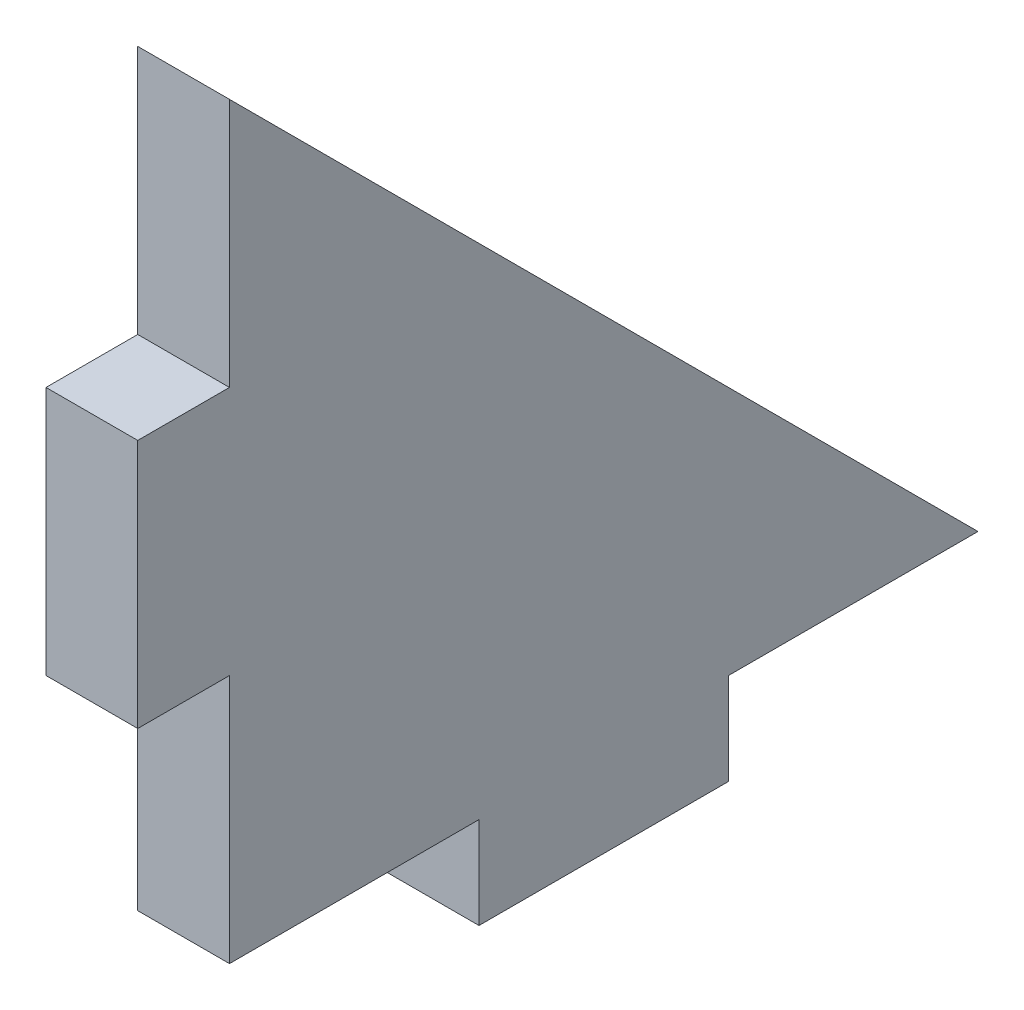
ISO-10303-21;
HEADER;
FILE_DESCRIPTION(('STEP AP214'),'2;1');
FILE_NAME('part.step','',(''),(''),'','','');
FILE_SCHEMA(('AUTOMOTIVE_DESIGN { 1 0 10303 214 1 1 1 1 }'));
ENDSEC;
DATA;
#1=APPLICATION_CONTEXT('core data for automotive mechanical design processes');
#2=APPLICATION_PROTOCOL_DEFINITION('international standard','automotive_design',2000,#1);
#3=PRODUCT_CONTEXT('',#1,'mechanical');
#4=PRODUCT('Part','Part','',(#3));
#5=PRODUCT_RELATED_PRODUCT_CATEGORY('part','',(#4));
#6=PRODUCT_DEFINITION_FORMATION('','',#4);
#7=PRODUCT_DEFINITION_CONTEXT('part definition',#1,'design');
#8=PRODUCT_DEFINITION('design','',#6,#7);
#9=PRODUCT_DEFINITION_SHAPE('','',#8);
#10=(LENGTH_UNIT() NAMED_UNIT(*) SI_UNIT(.MILLI.,.METRE.));
#11=(NAMED_UNIT(*) PLANE_ANGLE_UNIT() SI_UNIT($,.RADIAN.));
#12=(NAMED_UNIT(*) SI_UNIT($,.STERADIAN.) SOLID_ANGLE_UNIT());
#13=UNCERTAINTY_MEASURE_WITH_UNIT(LENGTH_MEASURE(1.E-05),#10,'distance_accuracy_value','');
#14=(GEOMETRIC_REPRESENTATION_CONTEXT(3) GLOBAL_UNCERTAINTY_ASSIGNED_CONTEXT((#13)) GLOBAL_UNIT_ASSIGNED_CONTEXT((#10,
#11,#12)) REPRESENTATION_CONTEXT('',''));
#15=CARTESIAN_POINT('',(0.,0.,0.));
#16=DIRECTION('',(0.,0.,1.));
#17=DIRECTION('',(1.,0.,0.));
#18=AXIS2_PLACEMENT_3D('',#15,#16,#17);
#19=CARTESIAN_POINT('',(2.6,0.,0.));
#20=DIRECTION('',(0.,0.,-1.));
#21=DIRECTION('',(-1.,0.,0.));
#22=AXIS2_PLACEMENT_3D('',#19,#20,#21);
#23=PLANE('',#22);
#24=DIRECTION('',(0.,-1.,0.));
#25=VECTOR('',#24,1.);
#26=CARTESIAN_POINT('',(0.,0.,0.));
#27=LINE('',#26,#25);
#28=CARTESIAN_POINT('',(0.,7.07106781186548,0.));
#29=VERTEX_POINT('',#28);
#30=CARTESIAN_POINT('',(0.,0.,0.));
#31=VERTEX_POINT('',#30);
#32=EDGE_CURVE('E144',#29,#31,#27,.T.);
#33=ORIENTED_EDGE('',*,*,#32,.T.);
#34=DIRECTION('',(-1.,0.,0.));
#35=VECTOR('',#34,1.);
#36=CARTESIAN_POINT('',(2.6,0.,0.));
#37=LINE('',#36,#35);
#38=CARTESIAN_POINT('',(2.6,0.,0.));
#39=VERTEX_POINT('',#38);
#40=EDGE_CURVE('E11',#39,#31,#37,.T.);
#41=ORIENTED_EDGE('',*,*,#40,.F.);
#42=DIRECTION('',(0.,-1.,0.));
#43=VECTOR('',#42,1.);
#44=CARTESIAN_POINT('',(2.6,0.,0.));
#45=LINE('',#44,#43);
#46=CARTESIAN_POINT('',(2.6,7.07106781186548,0.));
#47=VERTEX_POINT('',#46);
#48=EDGE_CURVE('E164',#47,#39,#45,.T.);
#49=ORIENTED_EDGE('',*,*,#48,.F.);
#50=DIRECTION('',(-1.,0.,0.));
#51=VECTOR('',#50,1.);
#52=CARTESIAN_POINT('',(2.6,7.07106781186548,0.));
#53=LINE('',#52,#51);
#54=EDGE_CURVE('E140',#47,#29,#53,.T.);
#55=ORIENTED_EDGE('',*,*,#54,.T.);
#56=EDGE_LOOP('',(#33,#41,#49,#55));
#57=FACE_BOUND('',#56,.T.);
#58=ADVANCED_FACE('F30',(#57),#23,.F.);
#59=CARTESIAN_POINT('',(2.6,0.,0.));
#60=DIRECTION('',(0.,1.,0.));
#61=DIRECTION('',(0.,0.,1.));
#62=AXIS2_PLACEMENT_3D('',#59,#60,#61);
#63=PLANE('',#62);
#64=DIRECTION('',(0.,0.,-1.));
#65=VECTOR('',#64,1.);
#66=CARTESIAN_POINT('',(0.,0.,0.));
#67=LINE('',#66,#65);
#68=CARTESIAN_POINT('',(0.,0.,-7.07106781186547));
#69=VERTEX_POINT('',#68);
#70=EDGE_CURVE('E147',#31,#69,#67,.T.);
#71=ORIENTED_EDGE('',*,*,#70,.T.);
#72=DIRECTION('',(-1.,0.,0.));
#73=VECTOR('',#72,1.);
#74=CARTESIAN_POINT('',(2.6,0.,-7.07106781186547));
#75=LINE('',#74,#73);
#76=CARTESIAN_POINT('',(2.6,0.,-7.07106781186547));
#77=VERTEX_POINT('',#76);
#78=EDGE_CURVE('E38',#77,#69,#75,.T.);
#79=ORIENTED_EDGE('',*,*,#78,.F.);
#80=DIRECTION('',(0.,0.,-1.));
#81=VECTOR('',#80,1.);
#82=CARTESIAN_POINT('',(2.6,0.,0.));
#83=LINE('',#82,#81);
#84=EDGE_CURVE('E98',#39,#77,#83,.T.);
#85=ORIENTED_EDGE('',*,*,#84,.F.);
#86=ORIENTED_EDGE('',*,*,#40,.T.);
#87=EDGE_LOOP('',(#71,#79,#85,#86));
#88=FACE_BOUND('',#87,.T.);
#89=ADVANCED_FACE('F236',(#88),#63,.F.);
#90=CARTESIAN_POINT('',(2.6,0.,-7.07106781186547));
#91=DIRECTION('',(0.,0.,-1.));
#92=DIRECTION('',(0.,1.,0.));
#93=AXIS2_PLACEMENT_3D('',#90,#91,#92);
#94=PLANE('',#93);
#95=DIRECTION('',(0.,-1.,0.));
#96=VECTOR('',#95,1.);
#97=CARTESIAN_POINT('',(0.,0.,-7.07106781186547));
#98=LINE('',#97,#96);
#99=CARTESIAN_POINT('',(0.,-2.6,-7.07106781186547));
#100=VERTEX_POINT('',#99);
#101=EDGE_CURVE('E149',#69,#100,#98,.T.);
#102=ORIENTED_EDGE('',*,*,#101,.T.);
#103=DIRECTION('',(-1.,0.,0.));
#104=VECTOR('',#103,1.);
#105=CARTESIAN_POINT('',(2.6,-2.6,-7.07106781186547));
#106=LINE('',#105,#104);
#107=CARTESIAN_POINT('',(2.6,-2.6,-7.07106781186547));
#108=VERTEX_POINT('',#107);
#109=EDGE_CURVE('E180',#108,#100,#106,.T.);
#110=ORIENTED_EDGE('',*,*,#109,.F.);
#111=DIRECTION('',(0.,-1.,0.));
#112=VECTOR('',#111,1.);
#113=CARTESIAN_POINT('',(2.6,0.,-7.07106781186547));
#114=LINE('',#113,#112);
#115=EDGE_CURVE('E188',#77,#108,#114,.T.);
#116=ORIENTED_EDGE('',*,*,#115,.F.);
#117=ORIENTED_EDGE('',*,*,#78,.T.);
#118=EDGE_LOOP('',(#102,#110,#116,#117));
#119=FACE_BOUND('',#118,.T.);
#120=ADVANCED_FACE('F186',(#119),#94,.F.);
#121=CARTESIAN_POINT('',(2.6,-2.6,-7.07106781186547));
#122=DIRECTION('',(0.,1.,0.));
#123=DIRECTION('',(0.,0.,1.));
#124=AXIS2_PLACEMENT_3D('',#121,#122,#123);
#125=PLANE('',#124);
#126=DIRECTION('',(0.,0.,-1.));
#127=VECTOR('',#126,1.);
#128=CARTESIAN_POINT('',(0.,-2.6,-7.07106781186547));
#129=LINE('',#128,#127);
#130=CARTESIAN_POINT('',(0.,-2.6,-14.1421356237309));
#131=VERTEX_POINT('',#130);
#132=EDGE_CURVE('E151',#100,#131,#129,.T.);
#133=ORIENTED_EDGE('',*,*,#132,.T.);
#134=DIRECTION('',(-1.,0.,0.));
#135=VECTOR('',#134,1.);
#136=CARTESIAN_POINT('',(2.6,-2.6,-14.1421356237309));
#137=LINE('',#136,#135);
#138=CARTESIAN_POINT('',(2.6,-2.6,-14.1421356237309));
#139=VERTEX_POINT('',#138);
#140=EDGE_CURVE('E177',#139,#131,#137,.T.);
#141=ORIENTED_EDGE('',*,*,#140,.F.);
#142=DIRECTION('',(0.,0.,-1.));
#143=VECTOR('',#142,1.);
#144=CARTESIAN_POINT('',(2.6,-2.6,-7.07106781186547));
#145=LINE('',#144,#143);
#146=EDGE_CURVE('E206',#108,#139,#145,.T.);
#147=ORIENTED_EDGE('',*,*,#146,.F.);
#148=ORIENTED_EDGE('',*,*,#109,.T.);
#149=EDGE_LOOP('',(#133,#141,#147,#148));
#150=FACE_BOUND('',#149,.T.);
#151=ADVANCED_FACE('F197',(#150),#125,.F.);
#152=CARTESIAN_POINT('',(2.6,0.,-14.1421356237309));
#153=DIRECTION('',(0.,0.,1.));
#154=DIRECTION('',(0.,-1.,0.));
#155=AXIS2_PLACEMENT_3D('',#152,#153,#154);
#156=PLANE('',#155);
#157=DIRECTION('',(0.,1.,0.));
#158=VECTOR('',#157,1.);
#159=CARTESIAN_POINT('',(0.,0.,-14.1421356237309));
#160=LINE('',#159,#158);
#161=CARTESIAN_POINT('',(0.,0.,-14.1421356237309));
#162=VERTEX_POINT('',#161);
#163=EDGE_CURVE('E153',#131,#162,#160,.T.);
#164=ORIENTED_EDGE('',*,*,#163,.T.);
#165=DIRECTION('',(-1.,0.,0.));
#166=VECTOR('',#165,1.);
#167=CARTESIAN_POINT('',(2.6,0.,-14.1421356237309));
#168=LINE('',#167,#166);
#169=CARTESIAN_POINT('',(2.6,0.,-14.1421356237309));
#170=VERTEX_POINT('',#169);
#171=EDGE_CURVE('E174',#170,#162,#168,.T.);
#172=ORIENTED_EDGE('',*,*,#171,.F.);
#173=DIRECTION('',(0.,1.,0.));
#174=VECTOR('',#173,1.);
#175=CARTESIAN_POINT('',(2.6,0.,-14.1421356237309));
#176=LINE('',#175,#174);
#177=EDGE_CURVE('E203',#139,#170,#176,.T.);
#178=ORIENTED_EDGE('',*,*,#177,.F.);
#179=ORIENTED_EDGE('',*,*,#140,.T.);
#180=EDGE_LOOP('',(#164,#172,#178,#179));
#181=FACE_BOUND('',#180,.T.);
#182=ADVANCED_FACE('F201',(#181),#156,.F.);
#183=CARTESIAN_POINT('',(2.6,0.,-14.1421356237309));
#184=DIRECTION('',(0.,1.,0.));
#185=DIRECTION('',(0.,0.,1.));
#186=AXIS2_PLACEMENT_3D('',#183,#184,#185);
#187=PLANE('',#186);
#188=DIRECTION('',(0.,0.,-1.));
#189=VECTOR('',#188,1.);
#190=CARTESIAN_POINT('',(0.,0.,-14.1421356237309));
#191=LINE('',#190,#189);
#192=CARTESIAN_POINT('',(0.,0.,-21.2132034355964));
#193=VERTEX_POINT('',#192);
#194=EDGE_CURVE('E155',#162,#193,#191,.T.);
#195=ORIENTED_EDGE('',*,*,#194,.T.);
#196=DIRECTION('',(-1.,0.,0.));
#197=VECTOR('',#196,1.);
#198=CARTESIAN_POINT('',(2.6,0.,-21.2132034355964));
#199=LINE('',#198,#197);
#200=CARTESIAN_POINT('',(2.6,0.,-21.2132034355964));
#201=VERTEX_POINT('',#200);
#202=EDGE_CURVE('E171',#201,#193,#199,.T.);
#203=ORIENTED_EDGE('',*,*,#202,.F.);
#204=DIRECTION('',(0.,0.,-1.));
#205=VECTOR('',#204,1.);
#206=CARTESIAN_POINT('',(2.6,0.,-14.1421356237309));
#207=LINE('',#206,#205);
#208=EDGE_CURVE('E205',#170,#201,#207,.T.);
#209=ORIENTED_EDGE('',*,*,#208,.F.);
#210=ORIENTED_EDGE('',*,*,#171,.T.);
#211=EDGE_LOOP('',(#195,#203,#209,#210));
#212=FACE_BOUND('',#211,.T.);
#213=ADVANCED_FACE('F249',(#212),#187,.F.);
#214=CARTESIAN_POINT('',(2.6,21.2132034355964,0.));
#215=DIRECTION('',(0.,-0.707106781186547,0.707106781186548));
#216=DIRECTION('',(0.,-0.707106781186548,-0.707106781186547));
#217=AXIS2_PLACEMENT_3D('',#214,#215,#216);
#218=PLANE('',#217);
#219=DIRECTION('',(0.,0.707106781186548,0.707106781186547));
#220=VECTOR('',#219,1.);
#221=CARTESIAN_POINT('',(0.,21.2132034355964,0.));
#222=LINE('',#221,#220);
#223=CARTESIAN_POINT('',(0.,21.2132034355964,0.));
#224=VERTEX_POINT('',#223);
#225=EDGE_CURVE('E157',#193,#224,#222,.T.);
#226=ORIENTED_EDGE('',*,*,#225,.T.);
#227=DIRECTION('',(-1.,0.,0.));
#228=VECTOR('',#227,1.);
#229=CARTESIAN_POINT('',(2.6,21.2132034355964,0.));
#230=LINE('',#229,#228);
#231=CARTESIAN_POINT('',(2.6,21.2132034355964,0.));
#232=VERTEX_POINT('',#231);
#233=EDGE_CURVE('E168',#232,#224,#230,.T.);
#234=ORIENTED_EDGE('',*,*,#233,.F.);
#235=DIRECTION('',(0.,0.707106781186548,0.707106781186547));
#236=VECTOR('',#235,1.);
#237=CARTESIAN_POINT('',(2.6,21.2132034355964,0.));
#238=LINE('',#237,#236);
#239=EDGE_CURVE('E208',#201,#232,#238,.T.);
#240=ORIENTED_EDGE('',*,*,#239,.F.);
#241=ORIENTED_EDGE('',*,*,#202,.T.);
#242=EDGE_LOOP('',(#226,#234,#240,#241));
#243=FACE_BOUND('',#242,.T.);
#244=ADVANCED_FACE('F217',(#243),#218,.F.);
#245=CARTESIAN_POINT('',(2.6,14.142135623731,0.));
#246=DIRECTION('',(0.,0.,-1.));
#247=DIRECTION('',(-1.,0.,0.));
#248=AXIS2_PLACEMENT_3D('',#245,#246,#247);
#249=PLANE('',#248);
#250=DIRECTION('',(0.,-1.,0.));
#251=VECTOR('',#250,1.);
#252=CARTESIAN_POINT('',(0.,14.142135623731,0.));
#253=LINE('',#252,#251);
#254=CARTESIAN_POINT('',(0.,14.142135623731,0.));
#255=VERTEX_POINT('',#254);
#256=EDGE_CURVE('E159',#224,#255,#253,.T.);
#257=ORIENTED_EDGE('',*,*,#256,.T.);
#258=DIRECTION('',(-1.,0.,0.));
#259=VECTOR('',#258,1.);
#260=CARTESIAN_POINT('',(2.6,14.142135623731,0.));
#261=LINE('',#260,#259);
#262=CARTESIAN_POINT('',(2.6,14.142135623731,0.));
#263=VERTEX_POINT('',#262);
#264=EDGE_CURVE('E135',#263,#255,#261,.T.);
#265=ORIENTED_EDGE('',*,*,#264,.F.);
#266=DIRECTION('',(0.,-1.,0.));
#267=VECTOR('',#266,1.);
#268=CARTESIAN_POINT('',(2.6,14.142135623731,0.));
#269=LINE('',#268,#267);
#270=EDGE_CURVE('E126',#232,#263,#269,.T.);
#271=ORIENTED_EDGE('',*,*,#270,.F.);
#272=ORIENTED_EDGE('',*,*,#233,.T.);
#273=EDGE_LOOP('',(#257,#265,#271,#272));
#274=FACE_BOUND('',#273,.T.);
#275=ADVANCED_FACE('F221',(#274),#249,.F.);
#276=CARTESIAN_POINT('',(2.6,14.142135623731,0.));
#277=DIRECTION('',(0.,-1.,0.));
#278=DIRECTION('',(0.,0.,-1.));
#279=AXIS2_PLACEMENT_3D('',#276,#277,#278);
#280=PLANE('',#279);
#281=DIRECTION('',(0.,0.,1.));
#282=VECTOR('',#281,1.);
#283=CARTESIAN_POINT('',(0.,14.142135623731,0.));
#284=LINE('',#283,#282);
#285=CARTESIAN_POINT('',(0.,14.142135623731,2.6));
#286=VERTEX_POINT('',#285);
#287=EDGE_CURVE('E134',#255,#286,#284,.T.);
#288=ORIENTED_EDGE('',*,*,#287,.T.);
#289=DIRECTION('',(-1.,0.,0.));
#290=VECTOR('',#289,1.);
#291=CARTESIAN_POINT('',(2.6,14.142135623731,2.6));
#292=LINE('',#291,#290);
#293=CARTESIAN_POINT('',(2.6,14.142135623731,2.6));
#294=VERTEX_POINT('',#293);
#295=EDGE_CURVE('E131',#294,#286,#292,.T.);
#296=ORIENTED_EDGE('',*,*,#295,.F.);
#297=DIRECTION('',(0.,0.,1.));
#298=VECTOR('',#297,1.);
#299=CARTESIAN_POINT('',(2.6,14.142135623731,0.));
#300=LINE('',#299,#298);
#301=EDGE_CURVE('E120',#263,#294,#300,.T.);
#302=ORIENTED_EDGE('',*,*,#301,.F.);
#303=ORIENTED_EDGE('',*,*,#264,.T.);
#304=EDGE_LOOP('',(#288,#296,#302,#303));
#305=FACE_BOUND('',#304,.T.);
#306=ADVANCED_FACE('F132',(#305),#280,.F.);
#307=CARTESIAN_POINT('',(2.6,14.142135623731,2.6));
#308=DIRECTION('',(0.,0.,-1.));
#309=DIRECTION('',(-1.,0.,0.));
#310=AXIS2_PLACEMENT_3D('',#307,#308,#309);
#311=PLANE('',#310);
#312=DIRECTION('',(0.,-1.,0.));
#313=VECTOR('',#312,1.);
#314=CARTESIAN_POINT('',(0.,14.142135623731,2.6));
#315=LINE('',#314,#313);
#316=CARTESIAN_POINT('',(0.,7.07106781186548,2.6));
#317=VERTEX_POINT('',#316);
#318=EDGE_CURVE('E84',#286,#317,#315,.T.);
#319=ORIENTED_EDGE('',*,*,#318,.T.);
#320=DIRECTION('',(-1.,0.,0.));
#321=VECTOR('',#320,1.);
#322=CARTESIAN_POINT('',(2.6,7.07106781186548,2.6));
#323=LINE('',#322,#321);
#324=CARTESIAN_POINT('',(2.6,7.07106781186548,2.6));
#325=VERTEX_POINT('',#324);
#326=EDGE_CURVE('E136',#325,#317,#323,.T.);
#327=ORIENTED_EDGE('',*,*,#326,.F.);
#328=DIRECTION('',(0.,-1.,0.));
#329=VECTOR('',#328,1.);
#330=CARTESIAN_POINT('',(2.6,14.142135623731,2.6));
#331=LINE('',#330,#329);
#332=EDGE_CURVE('E124',#294,#325,#331,.T.);
#333=ORIENTED_EDGE('',*,*,#332,.F.);
#334=ORIENTED_EDGE('',*,*,#295,.T.);
#335=EDGE_LOOP('',(#319,#327,#333,#334));
#336=FACE_BOUND('',#335,.T.);
#337=ADVANCED_FACE('F138',(#336),#311,.F.);
#338=CARTESIAN_POINT('',(2.6,7.07106781186548,0.));
#339=DIRECTION('',(0.,1.,0.));
#340=DIRECTION('',(0.,0.,1.));
#341=AXIS2_PLACEMENT_3D('',#338,#339,#340);
#342=PLANE('',#341);
#343=DIRECTION('',(0.,0.,-1.));
#344=VECTOR('',#343,1.);
#345=CARTESIAN_POINT('',(0.,7.07106781186548,0.));
#346=LINE('',#345,#344);
#347=EDGE_CURVE('E90',#317,#29,#346,.T.);
#348=ORIENTED_EDGE('',*,*,#347,.T.);
#349=ORIENTED_EDGE('',*,*,#54,.F.);
#350=DIRECTION('',(0.,0.,-1.));
#351=VECTOR('',#350,1.);
#352=CARTESIAN_POINT('',(2.6,7.07106781186548,0.));
#353=LINE('',#352,#351);
#354=EDGE_CURVE('E46',#325,#47,#353,.T.);
#355=ORIENTED_EDGE('',*,*,#354,.F.);
#356=ORIENTED_EDGE('',*,*,#326,.T.);
#357=EDGE_LOOP('',(#348,#349,#355,#356));
#358=FACE_BOUND('',#357,.T.);
#359=ADVANCED_FACE('F225',(#358),#342,.F.);
#360=CARTESIAN_POINT('',(2.6,7.07106781186548,0.));
#361=DIRECTION('',(1.,0.,0.));
#362=DIRECTION('',(0.,0.,-1.));
#363=AXIS2_PLACEMENT_3D('',#360,#361,#362);
#364=PLANE('',#363);
#365=ORIENTED_EDGE('',*,*,#48,.T.);
#366=ORIENTED_EDGE('',*,*,#84,.T.);
#367=ORIENTED_EDGE('',*,*,#115,.T.);
#368=ORIENTED_EDGE('',*,*,#146,.T.);
#369=ORIENTED_EDGE('',*,*,#177,.T.);
#370=ORIENTED_EDGE('',*,*,#208,.T.);
#371=ORIENTED_EDGE('',*,*,#239,.T.);
#372=ORIENTED_EDGE('',*,*,#270,.T.);
#373=ORIENTED_EDGE('',*,*,#301,.T.);
#374=ORIENTED_EDGE('',*,*,#332,.T.);
#375=ORIENTED_EDGE('',*,*,#354,.T.);
#376=EDGE_LOOP('',(#365,#366,#367,#368,#369,#370,#371,#372,#373,#374,#375));
#377=FACE_BOUND('',#376,.T.);
#378=ADVANCED_FACE('F122',(#377),#364,.T.);
#379=CARTESIAN_POINT('',(0.,7.07106781186548,0.));
#380=DIRECTION('',(1.,0.,0.));
#381=DIRECTION('',(0.,0.,-1.));
#382=AXIS2_PLACEMENT_3D('',#379,#380,#381);
#383=PLANE('',#382);
#384=ORIENTED_EDGE('',*,*,#32,.F.);
#385=ORIENTED_EDGE('',*,*,#347,.F.);
#386=ORIENTED_EDGE('',*,*,#318,.F.);
#387=ORIENTED_EDGE('',*,*,#287,.F.);
#388=ORIENTED_EDGE('',*,*,#256,.F.);
#389=ORIENTED_EDGE('',*,*,#225,.F.);
#390=ORIENTED_EDGE('',*,*,#194,.F.);
#391=ORIENTED_EDGE('',*,*,#163,.F.);
#392=ORIENTED_EDGE('',*,*,#132,.F.);
#393=ORIENTED_EDGE('',*,*,#101,.F.);
#394=ORIENTED_EDGE('',*,*,#70,.F.);
#395=EDGE_LOOP('',(#384,#385,#386,#387,#388,#389,#390,#391,#392,#393,#394));
#396=FACE_BOUND('',#395,.T.);
#397=ADVANCED_FACE('F192',(#396),#383,.F.);
#398=CLOSED_SHELL('',(#58,#89,#120,#151,#182,#213,#244,#275,#306,#337,#359,#378,#397));
#399=MANIFOLD_SOLID_BREP('B2',#398);
#400=ADVANCED_BREP_SHAPE_REPRESENTATION('',(#18,#399),#14);
#401=SHAPE_DEFINITION_REPRESENTATION(#9,#400);
ENDSEC;
END-ISO-10303-21;
